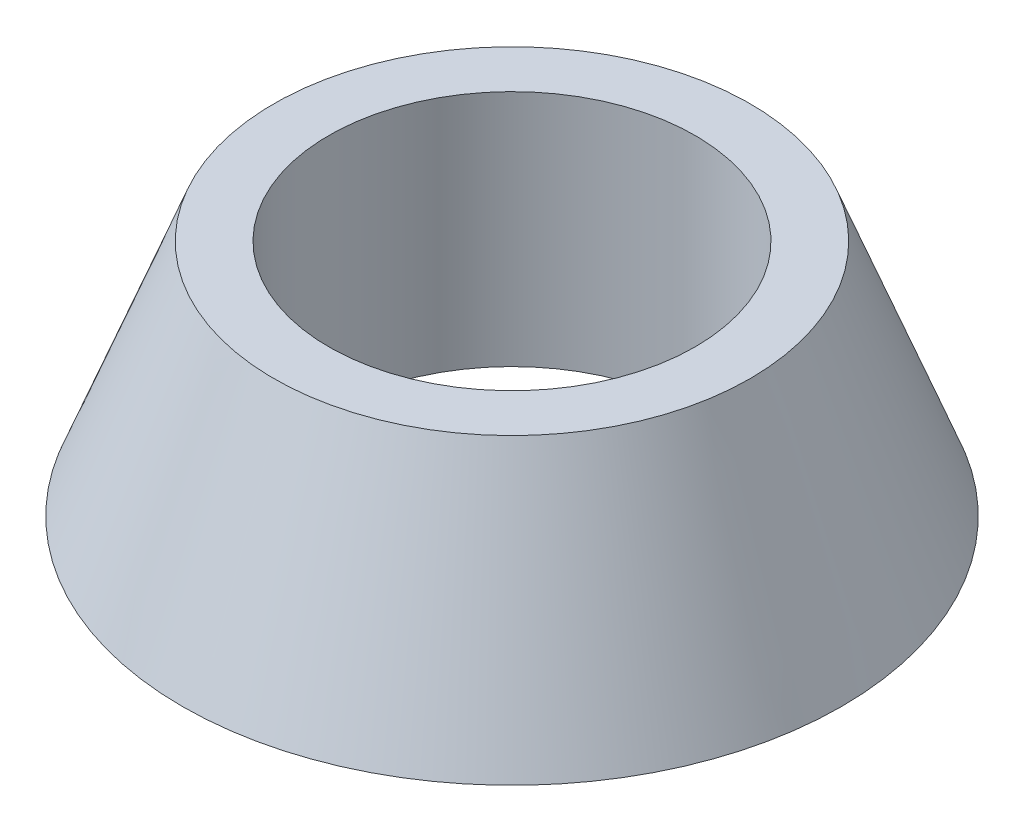
ISO-10303-21;
HEADER;
FILE_DESCRIPTION(('STEP AP214'),'2;1');
FILE_NAME('part.step','',(''),(''),'','','');
FILE_SCHEMA(('AUTOMOTIVE_DESIGN { 1 0 10303 214 1 1 1 1 }'));
ENDSEC;
DATA;
#1=APPLICATION_CONTEXT('core data for automotive mechanical design processes');
#2=APPLICATION_PROTOCOL_DEFINITION('international standard','automotive_design',2000,#1);
#3=PRODUCT_CONTEXT('',#1,'mechanical');
#4=PRODUCT('Part','Part','',(#3));
#5=PRODUCT_RELATED_PRODUCT_CATEGORY('part','',(#4));
#6=PRODUCT_DEFINITION_FORMATION('','',#4);
#7=PRODUCT_DEFINITION_CONTEXT('part definition',#1,'design');
#8=PRODUCT_DEFINITION('design','',#6,#7);
#9=PRODUCT_DEFINITION_SHAPE('','',#8);
#10=(LENGTH_UNIT() NAMED_UNIT(*) SI_UNIT(.MILLI.,.METRE.));
#11=(NAMED_UNIT(*) PLANE_ANGLE_UNIT() SI_UNIT($,.RADIAN.));
#12=(NAMED_UNIT(*) SI_UNIT($,.STERADIAN.) SOLID_ANGLE_UNIT());
#13=UNCERTAINTY_MEASURE_WITH_UNIT(LENGTH_MEASURE(1.E-05),#10,'distance_accuracy_value','');
#14=(GEOMETRIC_REPRESENTATION_CONTEXT(3) GLOBAL_UNCERTAINTY_ASSIGNED_CONTEXT((#13)) GLOBAL_UNIT_ASSIGNED_CONTEXT((#10,
#11,#12)) REPRESENTATION_CONTEXT('',''));
#15=CARTESIAN_POINT('',(0.,0.,0.));
#16=DIRECTION('',(0.,0.,1.));
#17=DIRECTION('',(1.,0.,0.));
#18=AXIS2_PLACEMENT_3D('',#15,#16,#17);
#19=CARTESIAN_POINT('',(9.,0.,0.));
#20=DIRECTION('',(0.,-1.,0.));
#21=DIRECTION('',(1.,0.,0.));
#22=AXIS2_PLACEMENT_3D('',#19,#20,#21);
#23=PLANE('',#22);
#24=CARTESIAN_POINT('',(0.,0.,0.));
#25=DIRECTION('',(0.,1.,0.));
#26=DIRECTION('',(1.,0.,0.));
#27=AXIS2_PLACEMENT_3D('',#24,#25,#26);
#28=CIRCLE('',#27,9.);
#29=CARTESIAN_POINT('',(9.,0.,0.));
#30=VERTEX_POINT('',#29);
#31=EDGE_CURVE('E49',#30,#30,#28,.T.);
#32=ORIENTED_EDGE('',*,*,#31,.F.);
#33=EDGE_LOOP('',(#32));
#34=FACE_BOUND('',#33,.T.);
#35=CARTESIAN_POINT('',(0.,0.,0.));
#36=DIRECTION('',(0.,1.,0.));
#37=DIRECTION('',(1.,0.,0.));
#38=AXIS2_PLACEMENT_3D('',#35,#36,#37);
#39=CIRCLE('',#38,5.);
#40=CARTESIAN_POINT('',(5.,0.,0.));
#41=VERTEX_POINT('',#40);
#42=EDGE_CURVE('E10',#41,#41,#39,.T.);
#43=ORIENTED_EDGE('',*,*,#42,.T.);
#44=EDGE_LOOP('',(#43));
#45=FACE_BOUND('',#44,.T.);
#46=ADVANCED_FACE('F35',(#34,#45),#23,.T.);
#47=CARTESIAN_POINT('',(0.,0.,0.));
#48=DIRECTION('',(0.,-1.,0.));
#49=DIRECTION('',(1.,0.,0.));
#50=AXIS2_PLACEMENT_3D('',#47,#48,#49);
#51=CYLINDRICAL_SURFACE('',#50,5.00000000000001);
#52=ORIENTED_EDGE('',*,*,#42,.F.);
#53=EDGE_LOOP('',(#52));
#54=FACE_BOUND('',#53,.T.);
#55=CARTESIAN_POINT('',(0.,6.49999999999998,0.));
#56=DIRECTION('',(0.,1.,0.));
#57=DIRECTION('',(1.,0.,0.));
#58=AXIS2_PLACEMENT_3D('',#55,#56,#57);
#59=CIRCLE('',#58,5.00000000000002);
#60=CARTESIAN_POINT('',(5.,6.5,0.));
#61=VERTEX_POINT('',#60);
#62=EDGE_CURVE('E41',#61,#61,#59,.T.);
#63=ORIENTED_EDGE('',*,*,#62,.T.);
#64=EDGE_LOOP('',(#63));
#65=FACE_BOUND('',#64,.T.);
#66=ADVANCED_FACE('F58',(#54,#65),#51,.F.);
#67=CARTESIAN_POINT('',(5.,6.5,0.));
#68=DIRECTION('',(0.,1.,0.));
#69=DIRECTION('',(-1.,0.,0.));
#70=AXIS2_PLACEMENT_3D('',#67,#68,#69);
#71=PLANE('',#70);
#72=ORIENTED_EDGE('',*,*,#62,.F.);
#73=EDGE_LOOP('',(#72));
#74=FACE_BOUND('',#73,.T.);
#75=CARTESIAN_POINT('',(0.,6.49999999999998,0.));
#76=DIRECTION('',(0.,1.,0.));
#77=DIRECTION('',(1.,0.,0.));
#78=AXIS2_PLACEMENT_3D('',#75,#76,#77);
#79=CIRCLE('',#78,6.50000000000002);
#80=CARTESIAN_POINT('',(6.5,6.5,0.));
#81=VERTEX_POINT('',#80);
#82=EDGE_CURVE('E45',#81,#81,#79,.T.);
#83=ORIENTED_EDGE('',*,*,#82,.T.);
#84=EDGE_LOOP('',(#83));
#85=FACE_BOUND('',#84,.T.);
#86=ADVANCED_FACE('F62',(#74,#85),#71,.T.);
#87=CARTESIAN_POINT('',(0.,0.,0.));
#88=DIRECTION('',(0.,-1.,0.));
#89=DIRECTION('',(1.,0.,0.));
#90=AXIS2_PLACEMENT_3D('',#87,#88,#89);
#91=CONICAL_SURFACE('',#90,9.,0.367173833818216);
#92=ORIENTED_EDGE('',*,*,#82,.F.);
#93=EDGE_LOOP('',(#92));
#94=FACE_BOUND('',#93,.T.);
#95=ORIENTED_EDGE('',*,*,#31,.T.);
#96=EDGE_LOOP('',(#95));
#97=FACE_BOUND('',#96,.T.);
#98=ADVANCED_FACE('F55',(#94,#97),#91,.T.);
#99=CLOSED_SHELL('',(#46,#66,#86,#98));
#100=MANIFOLD_SOLID_BREP('B2',#99);
#101=ADVANCED_BREP_SHAPE_REPRESENTATION('',(#18,#100),#14);
#102=SHAPE_DEFINITION_REPRESENTATION(#9,#101);
ENDSEC;
END-ISO-10303-21;
